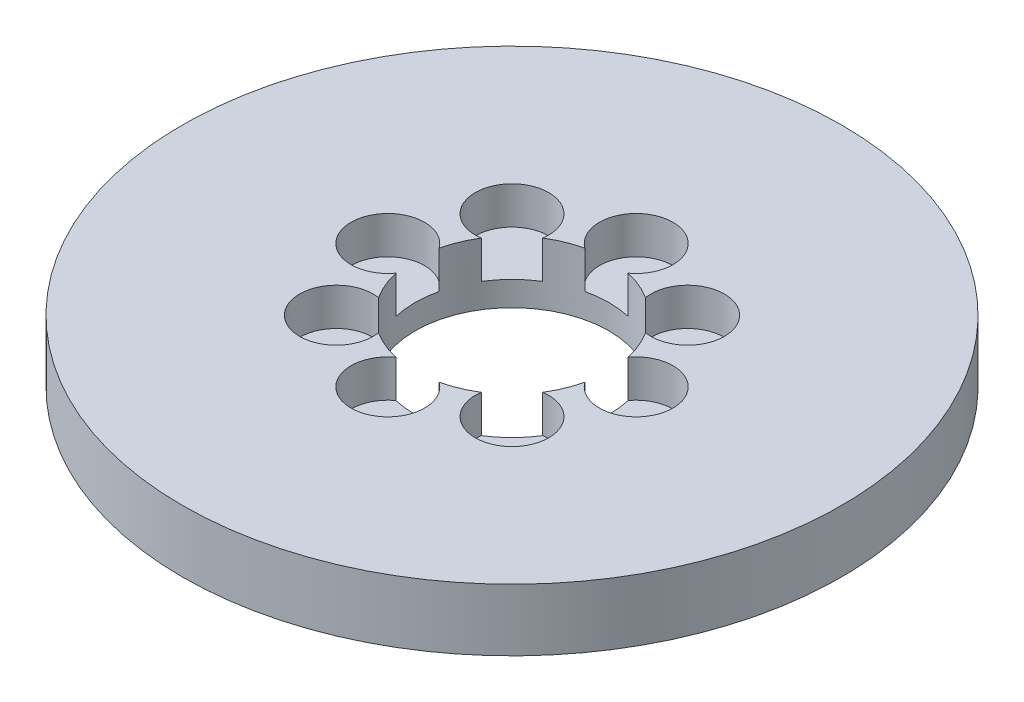
ISO-10303-21;
HEADER;
FILE_DESCRIPTION(('STEP AP214'),'2;1');
FILE_NAME('part.step','',(''),(''),'','','');
FILE_SCHEMA(('AUTOMOTIVE_DESIGN { 1 0 10303 214 1 1 1 1 }'));
ENDSEC;
DATA;
#1=APPLICATION_CONTEXT('core data for automotive mechanical design processes');
#2=APPLICATION_PROTOCOL_DEFINITION('international standard','automotive_design',2000,#1);
#3=PRODUCT_CONTEXT('',#1,'mechanical');
#4=PRODUCT('Part','Part','',(#3));
#5=PRODUCT_RELATED_PRODUCT_CATEGORY('part','',(#4));
#6=PRODUCT_DEFINITION_FORMATION('','',#4);
#7=PRODUCT_DEFINITION_CONTEXT('part definition',#1,'design');
#8=PRODUCT_DEFINITION('design','',#6,#7);
#9=PRODUCT_DEFINITION_SHAPE('','',#8);
#10=(LENGTH_UNIT() NAMED_UNIT(*) SI_UNIT(.MILLI.,.METRE.));
#11=(NAMED_UNIT(*) PLANE_ANGLE_UNIT() SI_UNIT($,.RADIAN.));
#12=(NAMED_UNIT(*) SI_UNIT($,.STERADIAN.) SOLID_ANGLE_UNIT());
#13=UNCERTAINTY_MEASURE_WITH_UNIT(LENGTH_MEASURE(1.E-05),#10,'distance_accuracy_value','');
#14=(GEOMETRIC_REPRESENTATION_CONTEXT(3) GLOBAL_UNCERTAINTY_ASSIGNED_CONTEXT((#13)) GLOBAL_UNIT_ASSIGNED_CONTEXT((#10,
#11,#12)) REPRESENTATION_CONTEXT('',''));
#15=CARTESIAN_POINT('',(0.,0.,0.));
#16=DIRECTION('',(0.,0.,1.));
#17=DIRECTION('',(1.,0.,0.));
#18=AXIS2_PLACEMENT_3D('',#15,#16,#17);
#19=CARTESIAN_POINT('',(0.,16.,0.));
#20=DIRECTION('',(0.,-1.,0.));
#21=DIRECTION('',(0.,0.,-1.));
#22=AXIS2_PLACEMENT_3D('',#19,#20,#21);
#23=CYLINDRICAL_SURFACE('',#22,85.);
#24=CARTESIAN_POINT('',(0.,16.,0.));
#25=DIRECTION('',(0.,1.,0.));
#26=DIRECTION('',(0.,0.,1.));
#27=AXIS2_PLACEMENT_3D('',#24,#25,#26);
#28=CIRCLE('',#27,85.);
#29=CARTESIAN_POINT('',(0.,16.,85.));
#30=VERTEX_POINT('',#29);
#31=EDGE_CURVE('E195',#30,#30,#28,.T.);
#32=ORIENTED_EDGE('',*,*,#31,.F.);
#33=EDGE_LOOP('',(#32));
#34=FACE_BOUND('',#33,.T.);
#35=CARTESIAN_POINT('',(0.,0.,0.));
#36=DIRECTION('',(0.,1.,0.));
#37=DIRECTION('',(0.,0.,1.));
#38=AXIS2_PLACEMENT_3D('',#35,#36,#37);
#39=CIRCLE('',#38,85.);
#40=CARTESIAN_POINT('',(0.,0.,85.));
#41=VERTEX_POINT('',#40);
#42=EDGE_CURVE('E179',#41,#41,#39,.T.);
#43=ORIENTED_EDGE('',*,*,#42,.T.);
#44=EDGE_LOOP('',(#43));
#45=FACE_BOUND('',#44,.T.);
#46=ADVANCED_FACE('F39',(#34,#45),#23,.T.);
#47=CARTESIAN_POINT('',(0.,16.,0.));
#48=DIRECTION('',(0.,1.,0.));
#49=DIRECTION('',(0.,0.,1.));
#50=AXIS2_PLACEMENT_3D('',#47,#48,#49);
#51=PLANE('',#50);
#52=CARTESIAN_POINT('',(1.11835622475509E-13,16.,32.030995334652));
#53=DIRECTION('',(0.,1.,0.));
#54=DIRECTION('',(1.,0.,0.));
#55=AXIS2_PLACEMENT_3D('',#52,#53,#54);
#56=CIRCLE('',#55,9.48192485380572);
#57=CARTESIAN_POINT('',(-5.58471411031341,16.,24.3682368731524));
#58=VERTEX_POINT('',#57);
#59=CARTESIAN_POINT('',(5.58471411031358,16.,24.3682368731524));
#60=VERTEX_POINT('',#59);
#61=EDGE_CURVE('E176',#58,#60,#56,.T.);
#62=ORIENTED_EDGE('',*,*,#61,.F.);
#63=CARTESIAN_POINT('',(0.,16.,0.));
#64=DIRECTION('',(0.,1.,0.));
#65=DIRECTION('',(0.,0.,1.));
#66=AXIS2_PLACEMENT_3D('',#63,#64,#65);
#67=CIRCLE('',#66,25.);
#68=CARTESIAN_POINT('',(-13.2819563201752,16.,21.179934756957));
#69=VERTEX_POINT('',#68);
#70=EDGE_CURVE('E166',#69,#58,#67,.T.);
#71=ORIENTED_EDGE('',*,*,#70,.F.);
#72=CARTESIAN_POINT('',(-22.6493340092871,16.,22.6493340092872));
#73=DIRECTION('',(0.,1.,0.));
#74=DIRECTION('',(0.707106781186549,0.,0.707106781186546));
#75=AXIS2_PLACEMENT_3D('',#72,#73,#74);
#76=CIRCLE('',#75,9.48192485380572);
#77=CARTESIAN_POINT('',(-21.179934756957,16.,13.2819563201753));
#78=VERTEX_POINT('',#77);
#79=EDGE_CURVE('E147',#78,#69,#76,.T.);
#80=ORIENTED_EDGE('',*,*,#79,.F.);
#81=CARTESIAN_POINT('',(-24.3682368731524,16.,5.5847141103135));
#82=VERTEX_POINT('',#81);
#83=EDGE_CURVE('E180',#82,#78,#67,.T.);
#84=ORIENTED_EDGE('',*,*,#83,.F.);
#85=CARTESIAN_POINT('',(-32.030995334652,16.,0.));
#86=DIRECTION('',(0.,1.,0.));
#87=DIRECTION('',(0.,0.,1.));
#88=AXIS2_PLACEMENT_3D('',#85,#86,#87);
#89=CIRCLE('',#88,9.48192485380572);
#90=CARTESIAN_POINT('',(-24.3682368731524,16.,-5.5847141103135));
#91=VERTEX_POINT('',#90);
#92=EDGE_CURVE('E186',#91,#82,#89,.T.);
#93=ORIENTED_EDGE('',*,*,#92,.F.);
#94=CARTESIAN_POINT('',(-21.1799347569572,16.,-13.281956320175));
#95=VERTEX_POINT('',#94);
#96=EDGE_CURVE('E182',#95,#91,#67,.T.);
#97=ORIENTED_EDGE('',*,*,#96,.F.);
#98=CARTESIAN_POINT('',(-22.6493340092874,16.,-22.6493340092868));
#99=DIRECTION('',(0.,1.,0.));
#100=DIRECTION('',(-0.707106781186539,0.,0.707106781186556));
#101=AXIS2_PLACEMENT_3D('',#98,#99,#100);
#102=CIRCLE('',#101,9.48192485380572);
#103=CARTESIAN_POINT('',(-13.2819563201755,16.,-21.1799347569569));
#104=VERTEX_POINT('',#103);
#105=EDGE_CURVE('E446',#104,#95,#102,.T.);
#106=ORIENTED_EDGE('',*,*,#105,.F.);
#107=CARTESIAN_POINT('',(-5.58471411031375,16.,-24.3682368731524));
#108=VERTEX_POINT('',#107);
#109=EDGE_CURVE('E452',#108,#104,#67,.T.);
#110=ORIENTED_EDGE('',*,*,#109,.F.);
#111=CARTESIAN_POINT('',(-3.35506867426527E-13,16.,-32.030995334652));
#112=DIRECTION('',(0.,1.,0.));
#113=DIRECTION('',(-1.,0.,0.));
#114=AXIS2_PLACEMENT_3D('',#111,#112,#113);
#115=CIRCLE('',#114,9.48192485380572);
#116=CARTESIAN_POINT('',(5.58471411031324,16.,-24.3682368731525));
#117=VERTEX_POINT('',#116);
#118=EDGE_CURVE('E477',#117,#108,#115,.T.);
#119=ORIENTED_EDGE('',*,*,#118,.F.);
#120=CARTESIAN_POINT('',(13.2819563201751,16.,-21.1799347569571));
#121=VERTEX_POINT('',#120);
#122=EDGE_CURVE('E460',#121,#117,#67,.T.);
#123=ORIENTED_EDGE('',*,*,#122,.F.);
#124=CARTESIAN_POINT('',(22.6493340092869,16.,-22.6493340092873));
#125=DIRECTION('',(0.,1.,0.));
#126=DIRECTION('',(-0.707106781186554,0.,-0.707106781186541));
#127=AXIS2_PLACEMENT_3D('',#124,#125,#126);
#128=CIRCLE('',#127,9.48192485380572);
#129=CARTESIAN_POINT('',(21.1799347569569,16.,-13.2819563201755));
#130=VERTEX_POINT('',#129);
#131=EDGE_CURVE('E464',#130,#121,#128,.T.);
#132=ORIENTED_EDGE('',*,*,#131,.F.);
#133=CARTESIAN_POINT('',(24.3682368731524,16.,-5.5847141103135));
#134=VERTEX_POINT('',#133);
#135=EDGE_CURVE('E459',#134,#130,#67,.T.);
#136=ORIENTED_EDGE('',*,*,#135,.F.);
#137=CARTESIAN_POINT('',(32.030995334652,16.,0.));
#138=DIRECTION('',(0.,1.,0.));
#139=DIRECTION('',(0.,0.,-1.));
#140=AXIS2_PLACEMENT_3D('',#137,#138,#139);
#141=CIRCLE('',#140,9.48192485380572);
#142=CARTESIAN_POINT('',(24.3682368731524,16.,5.5847141103135));
#143=VERTEX_POINT('',#142);
#144=EDGE_CURVE('E469',#143,#134,#141,.T.);
#145=ORIENTED_EDGE('',*,*,#144,.F.);
#146=CARTESIAN_POINT('',(21.1799347569571,16.,13.2819563201752));
#147=VERTEX_POINT('',#146);
#148=EDGE_CURVE('E181',#147,#143,#67,.T.);
#149=ORIENTED_EDGE('',*,*,#148,.F.);
#150=CARTESIAN_POINT('',(22.6493340092872,16.,22.649334009287));
#151=DIRECTION('',(0.,1.,0.));
#152=DIRECTION('',(0.707106781186544,0.,-0.707106781186551));
#153=AXIS2_PLACEMENT_3D('',#150,#151,#152);
#154=CIRCLE('',#153,9.48192485380572);
#155=CARTESIAN_POINT('',(13.2819563201754,16.,21.1799347569569));
#156=VERTEX_POINT('',#155);
#157=EDGE_CURVE('E475',#156,#147,#154,.T.);
#158=ORIENTED_EDGE('',*,*,#157,.F.);
#159=EDGE_CURVE('E177',#60,#156,#67,.T.);
#160=ORIENTED_EDGE('',*,*,#159,.F.);
#161=EDGE_LOOP('',(#62,#71,#80,#84,#93,#97,#106,#110,#119,#123,#132,#136,#145,#149,#158,#160));
#162=FACE_BOUND('',#161,.T.);
#163=ORIENTED_EDGE('',*,*,#31,.T.);
#164=EDGE_LOOP('',(#163));
#165=FACE_BOUND('',#164,.T.);
#166=ADVANCED_FACE('F172',(#162,#165),#51,.T.);
#167=CARTESIAN_POINT('',(0.,0.,0.));
#168=DIRECTION('',(0.,1.,0.));
#169=DIRECTION('',(0.,0.,1.));
#170=AXIS2_PLACEMENT_3D('',#167,#168,#169);
#171=PLANE('',#170);
#172=CARTESIAN_POINT('',(0.,0.,0.));
#173=DIRECTION('',(0.,1.,0.));
#174=DIRECTION('',(0.,0.,1.));
#175=AXIS2_PLACEMENT_3D('',#172,#173,#174);
#176=CIRCLE('',#175,25.);
#177=CARTESIAN_POINT('',(0.,0.,25.));
#178=VERTEX_POINT('',#177);
#179=EDGE_CURVE('E187',#178,#178,#176,.T.);
#180=ORIENTED_EDGE('',*,*,#179,.T.);
#181=EDGE_LOOP('',(#180));
#182=FACE_BOUND('',#181,.T.);
#183=ORIENTED_EDGE('',*,*,#42,.F.);
#184=EDGE_LOOP('',(#183));
#185=FACE_BOUND('',#184,.T.);
#186=ADVANCED_FACE('F270',(#182,#185),#171,.F.);
#187=CARTESIAN_POINT('',(0.,16.,0.));
#188=DIRECTION('',(0.,-1.,0.));
#189=DIRECTION('',(0.,0.,-1.));
#190=AXIS2_PLACEMENT_3D('',#187,#188,#189);
#191=CYLINDRICAL_SURFACE('',#190,25.);
#192=DIRECTION('',(0.,1.,0.));
#193=VECTOR('',#192,1.);
#194=CARTESIAN_POINT('',(-5.58471411031342,11.1634950913703,24.3682368731524));
#195=LINE('',#194,#193);
#196=CARTESIAN_POINT('',(-5.58471411031341,6.32699018274064,24.3682368731524));
#197=VERTEX_POINT('',#196);
#198=EDGE_CURVE('E11',#197,#58,#195,.T.);
#199=ORIENTED_EDGE('',*,*,#198,.F.);
#200=CARTESIAN_POINT('',(0.,6.32699018274064,0.));
#201=DIRECTION('',(0.,1.,0.));
#202=DIRECTION('',(0.,0.,1.));
#203=AXIS2_PLACEMENT_3D('',#200,#201,#202);
#204=CIRCLE('',#203,25.);
#205=CARTESIAN_POINT('',(5.58471411031358,6.32699018274064,24.3682368731524));
#206=VERTEX_POINT('',#205);
#207=EDGE_CURVE('E250',#197,#206,#204,.T.);
#208=ORIENTED_EDGE('',*,*,#207,.T.);
#209=DIRECTION('',(0.,1.,0.));
#210=VECTOR('',#209,1.);
#211=CARTESIAN_POINT('',(5.58471411031359,11.1634950913703,24.3682368731524));
#212=LINE('',#211,#210);
#213=EDGE_CURVE('E46',#60,#206,#212,.F.);
#214=ORIENTED_EDGE('',*,*,#213,.F.);
#215=ORIENTED_EDGE('',*,*,#159,.T.);
#216=DIRECTION('',(0.,1.,0.));
#217=VECTOR('',#216,1.);
#218=CARTESIAN_POINT('',(13.2819563201754,11.1634950913703,21.179934756957));
#219=LINE('',#218,#217);
#220=CARTESIAN_POINT('',(13.2819563201754,6.32699018274064,21.1799347569569));
#221=VERTEX_POINT('',#220);
#222=EDGE_CURVE('E244',#221,#156,#219,.T.);
#223=ORIENTED_EDGE('',*,*,#222,.F.);
#224=CARTESIAN_POINT('',(0.,6.32699018274064,0.));
#225=DIRECTION('',(0.,1.,0.));
#226=DIRECTION('',(0.,0.,1.));
#227=AXIS2_PLACEMENT_3D('',#224,#225,#226);
#228=CIRCLE('',#227,25.);
#229=CARTESIAN_POINT('',(21.1799347569571,6.32699018274064,13.2819563201752));
#230=VERTEX_POINT('',#229);
#231=EDGE_CURVE('E238',#221,#230,#228,.T.);
#232=ORIENTED_EDGE('',*,*,#231,.T.);
#233=DIRECTION('',(0.,1.,0.));
#234=VECTOR('',#233,1.);
#235=CARTESIAN_POINT('',(21.1799347569571,11.1634950913703,13.2819563201752));
#236=LINE('',#235,#234);
#237=EDGE_CURVE('E242',#147,#230,#236,.F.);
#238=ORIENTED_EDGE('',*,*,#237,.F.);
#239=ORIENTED_EDGE('',*,*,#148,.T.);
#240=DIRECTION('',(0.,1.,0.));
#241=VECTOR('',#240,1.);
#242=CARTESIAN_POINT('',(24.3682368731524,11.1634950913703,5.58471411031351));
#243=LINE('',#242,#241);
#244=CARTESIAN_POINT('',(24.3682368731524,6.32699018274064,5.5847141103135));
#245=VERTEX_POINT('',#244);
#246=EDGE_CURVE('E236',#245,#143,#243,.T.);
#247=ORIENTED_EDGE('',*,*,#246,.F.);
#248=CARTESIAN_POINT('',(0.,6.32699018274064,0.));
#249=DIRECTION('',(0.,1.,0.));
#250=DIRECTION('',(0.,0.,1.));
#251=AXIS2_PLACEMENT_3D('',#248,#249,#250);
#252=CIRCLE('',#251,25.);
#253=CARTESIAN_POINT('',(24.3682368731524,6.32699018274064,-5.5847141103135));
#254=VERTEX_POINT('',#253);
#255=EDGE_CURVE('E235',#245,#254,#252,.T.);
#256=ORIENTED_EDGE('',*,*,#255,.T.);
#257=DIRECTION('',(0.,1.,0.));
#258=VECTOR('',#257,1.);
#259=CARTESIAN_POINT('',(24.3682368731524,11.1634950913703,-5.58471411031351));
#260=LINE('',#259,#258);
#261=EDGE_CURVE('E234',#134,#254,#260,.F.);
#262=ORIENTED_EDGE('',*,*,#261,.F.);
#263=ORIENTED_EDGE('',*,*,#135,.T.);
#264=DIRECTION('',(0.,1.,0.));
#265=VECTOR('',#264,1.);
#266=CARTESIAN_POINT('',(21.1799347569569,11.1634950913703,-13.2819563201755));
#267=LINE('',#266,#265);
#268=CARTESIAN_POINT('',(21.1799347569569,6.32699018274064,-13.2819563201755));
#269=VERTEX_POINT('',#268);
#270=EDGE_CURVE('E229',#269,#130,#267,.T.);
#271=ORIENTED_EDGE('',*,*,#270,.F.);
#272=CARTESIAN_POINT('',(0.,6.32699018274064,0.));
#273=DIRECTION('',(0.,1.,0.));
#274=DIRECTION('',(0.,0.,1.));
#275=AXIS2_PLACEMENT_3D('',#272,#273,#274);
#276=CIRCLE('',#275,25.);
#277=CARTESIAN_POINT('',(13.2819563201751,6.32699018274064,-21.1799347569571));
#278=VERTEX_POINT('',#277);
#279=EDGE_CURVE('E221',#269,#278,#276,.T.);
#280=ORIENTED_EDGE('',*,*,#279,.T.);
#281=DIRECTION('',(0.,1.,0.));
#282=VECTOR('',#281,1.);
#283=CARTESIAN_POINT('',(13.2819563201751,11.1634950913703,-21.1799347569571));
#284=LINE('',#283,#282);
#285=EDGE_CURVE('E230',#121,#278,#284,.F.);
#286=ORIENTED_EDGE('',*,*,#285,.F.);
#287=ORIENTED_EDGE('',*,*,#122,.T.);
#288=DIRECTION('',(0.,1.,0.));
#289=VECTOR('',#288,1.);
#290=CARTESIAN_POINT('',(5.58471411031325,11.1634950913703,-24.3682368731525));
#291=LINE('',#290,#289);
#292=CARTESIAN_POINT('',(5.58471411031324,6.32699018274064,-24.3682368731525));
#293=VERTEX_POINT('',#292);
#294=EDGE_CURVE('E225',#293,#117,#291,.T.);
#295=ORIENTED_EDGE('',*,*,#294,.F.);
#296=CARTESIAN_POINT('',(0.,6.32699018274064,0.));
#297=DIRECTION('',(0.,1.,0.));
#298=DIRECTION('',(0.,0.,1.));
#299=AXIS2_PLACEMENT_3D('',#296,#297,#298);
#300=CIRCLE('',#299,25.);
#301=CARTESIAN_POINT('',(-5.58471411031375,6.32699018274064,-24.3682368731524));
#302=VERTEX_POINT('',#301);
#303=EDGE_CURVE('E216',#293,#302,#300,.T.);
#304=ORIENTED_EDGE('',*,*,#303,.T.);
#305=DIRECTION('',(0.,1.,0.));
#306=VECTOR('',#305,1.);
#307=CARTESIAN_POINT('',(-5.58471411031376,11.1634950913703,-24.3682368731524));
#308=LINE('',#307,#306);
#309=EDGE_CURVE('E218',#108,#302,#308,.F.);
#310=ORIENTED_EDGE('',*,*,#309,.F.);
#311=ORIENTED_EDGE('',*,*,#109,.T.);
#312=DIRECTION('',(0.,1.,0.));
#313=VECTOR('',#312,1.);
#314=CARTESIAN_POINT('',(-13.2819563201755,11.1634950913703,-21.1799347569569));
#315=LINE('',#314,#313);
#316=CARTESIAN_POINT('',(-13.2819563201755,6.32699018274064,-21.1799347569569));
#317=VERTEX_POINT('',#316);
#318=EDGE_CURVE('E212',#317,#104,#315,.T.);
#319=ORIENTED_EDGE('',*,*,#318,.F.);
#320=CARTESIAN_POINT('',(0.,6.32699018274064,0.));
#321=DIRECTION('',(0.,1.,0.));
#322=DIRECTION('',(0.,0.,1.));
#323=AXIS2_PLACEMENT_3D('',#320,#321,#322);
#324=CIRCLE('',#323,25.);
#325=CARTESIAN_POINT('',(-21.1799347569572,6.32699018274064,-13.281956320175));
#326=VERTEX_POINT('',#325);
#327=EDGE_CURVE('E208',#317,#326,#324,.T.);
#328=ORIENTED_EDGE('',*,*,#327,.T.);
#329=DIRECTION('',(0.,1.,0.));
#330=VECTOR('',#329,1.);
#331=CARTESIAN_POINT('',(-21.1799347569572,11.1634950913703,-13.281956320175));
#332=LINE('',#331,#330);
#333=EDGE_CURVE('E211',#95,#326,#332,.F.);
#334=ORIENTED_EDGE('',*,*,#333,.F.);
#335=ORIENTED_EDGE('',*,*,#96,.T.);
#336=DIRECTION('',(0.,1.,0.));
#337=VECTOR('',#336,1.);
#338=CARTESIAN_POINT('',(-24.3682368731524,11.1634950913703,-5.58471411031351));
#339=LINE('',#338,#337);
#340=CARTESIAN_POINT('',(-24.3682368731524,6.32699018274064,-5.5847141103135));
#341=VERTEX_POINT('',#340);
#342=EDGE_CURVE('E201',#341,#91,#339,.T.);
#343=ORIENTED_EDGE('',*,*,#342,.F.);
#344=CARTESIAN_POINT('',(0.,6.32699018274064,0.));
#345=DIRECTION('',(0.,1.,0.));
#346=DIRECTION('',(0.,0.,1.));
#347=AXIS2_PLACEMENT_3D('',#344,#345,#346);
#348=CIRCLE('',#347,25.);
#349=CARTESIAN_POINT('',(-24.3682368731524,6.32699018274064,5.5847141103135));
#350=VERTEX_POINT('',#349);
#351=EDGE_CURVE('E194',#341,#350,#348,.T.);
#352=ORIENTED_EDGE('',*,*,#351,.T.);
#353=DIRECTION('',(0.,1.,0.));
#354=VECTOR('',#353,1.);
#355=CARTESIAN_POINT('',(-24.3682368731524,11.1634950913703,5.58471411031351));
#356=LINE('',#355,#354);
#357=EDGE_CURVE('E199',#82,#350,#356,.F.);
#358=ORIENTED_EDGE('',*,*,#357,.F.);
#359=ORIENTED_EDGE('',*,*,#83,.T.);
#360=DIRECTION('',(0.,1.,0.));
#361=VECTOR('',#360,1.);
#362=CARTESIAN_POINT('',(-21.179934756957,11.1634950913703,13.2819563201753));
#363=LINE('',#362,#361);
#364=CARTESIAN_POINT('',(-21.179934756957,6.32699018274064,13.2819563201753));
#365=VERTEX_POINT('',#364);
#366=EDGE_CURVE('E160',#365,#78,#363,.T.);
#367=ORIENTED_EDGE('',*,*,#366,.F.);
#368=CARTESIAN_POINT('',(0.,6.32699018274064,0.));
#369=DIRECTION('',(0.,1.,0.));
#370=DIRECTION('',(0.,0.,1.));
#371=AXIS2_PLACEMENT_3D('',#368,#369,#370);
#372=CIRCLE('',#371,25.);
#373=CARTESIAN_POINT('',(-13.2819563201752,6.32699018274064,21.179934756957));
#374=VERTEX_POINT('',#373);
#375=EDGE_CURVE('E168',#365,#374,#372,.T.);
#376=ORIENTED_EDGE('',*,*,#375,.T.);
#377=DIRECTION('',(0.,1.,0.));
#378=VECTOR('',#377,1.);
#379=CARTESIAN_POINT('',(-13.2819563201752,11.1634950913703,21.179934756957));
#380=LINE('',#379,#378);
#381=EDGE_CURVE('E152',#69,#374,#380,.F.);
#382=ORIENTED_EDGE('',*,*,#381,.F.);
#383=ORIENTED_EDGE('',*,*,#70,.T.);
#384=EDGE_LOOP('',(#199,#208,#214,#215,#223,#232,#238,#239,#247,#256,#262,#263,#271,#280,#286,
#287,#295,#304,#310,#311,#319,#328,#334,#335,#343,#352,#358,#359,#367,#376,#382,#383));
#385=FACE_BOUND('',#384,.T.);
#386=ORIENTED_EDGE('',*,*,#179,.F.);
#387=EDGE_LOOP('',(#386));
#388=FACE_BOUND('',#387,.T.);
#389=ADVANCED_FACE('F170',(#385,#388),#191,.F.);
#390=CARTESIAN_POINT('',(-32.030995334652,6.32699018274064,0.));
#391=DIRECTION('',(0.,1.,0.));
#392=DIRECTION('',(0.,0.,1.));
#393=AXIS2_PLACEMENT_3D('',#390,#391,#392);
#394=CYLINDRICAL_SURFACE('',#393,9.48192485380572);
#395=ORIENTED_EDGE('',*,*,#342,.T.);
#396=ORIENTED_EDGE('',*,*,#92,.T.);
#397=ORIENTED_EDGE('',*,*,#357,.T.);
#398=CARTESIAN_POINT('',(-32.030995334652,6.32699018274064,0.));
#399=DIRECTION('',(0.,1.,0.));
#400=DIRECTION('',(0.,0.,1.));
#401=AXIS2_PLACEMENT_3D('',#398,#399,#400);
#402=CIRCLE('',#401,9.48192485380572);
#403=EDGE_CURVE('E191',#341,#350,#402,.T.);
#404=ORIENTED_EDGE('',*,*,#403,.F.);
#405=EDGE_LOOP('',(#395,#396,#397,#404));
#406=FACE_BOUND('',#405,.T.);
#407=ADVANCED_FACE('F279',(#406),#394,.F.);
#408=CARTESIAN_POINT('',(-32.030995334652,6.32699018274064,0.));
#409=DIRECTION('',(0.,1.,0.));
#410=DIRECTION('',(0.,0.,1.));
#411=AXIS2_PLACEMENT_3D('',#408,#409,#410);
#412=PLANE('',#411);
#413=ORIENTED_EDGE('',*,*,#403,.T.);
#414=ORIENTED_EDGE('',*,*,#351,.F.);
#415=EDGE_LOOP('',(#413,#414));
#416=FACE_BOUND('',#415,.T.);
#417=ADVANCED_FACE('F285',(#416),#412,.T.);
#418=CARTESIAN_POINT('',(-22.6493340092871,6.32699018274064,22.6493340092872));
#419=DIRECTION('',(0.,1.,0.));
#420=DIRECTION('',(0.,0.,1.));
#421=AXIS2_PLACEMENT_3D('',#418,#419,#420);
#422=CYLINDRICAL_SURFACE('',#421,9.48192485380572);
#423=ORIENTED_EDGE('',*,*,#366,.T.);
#424=ORIENTED_EDGE('',*,*,#79,.T.);
#425=ORIENTED_EDGE('',*,*,#381,.T.);
#426=CARTESIAN_POINT('',(-22.6493340092871,6.32699018274064,22.6493340092872));
#427=DIRECTION('',(0.,1.,0.));
#428=DIRECTION('',(0.707106781186549,0.,0.707106781186546));
#429=AXIS2_PLACEMENT_3D('',#426,#427,#428);
#430=CIRCLE('',#429,9.48192485380572);
#431=EDGE_CURVE('E165',#365,#374,#430,.T.);
#432=ORIENTED_EDGE('',*,*,#431,.F.);
#433=EDGE_LOOP('',(#423,#424,#425,#432));
#434=FACE_BOUND('',#433,.T.);
#435=ADVANCED_FACE('F155',(#434),#422,.F.);
#436=CARTESIAN_POINT('',(-22.6493340092871,6.32699018274064,22.6493340092872));
#437=DIRECTION('',(0.,1.,0.));
#438=DIRECTION('',(0.707106781186549,0.,0.707106781186546));
#439=AXIS2_PLACEMENT_3D('',#436,#437,#438);
#440=PLANE('',#439);
#441=ORIENTED_EDGE('',*,*,#431,.T.);
#442=ORIENTED_EDGE('',*,*,#375,.F.);
#443=EDGE_LOOP('',(#441,#442));
#444=FACE_BOUND('',#443,.T.);
#445=ADVANCED_FACE('F288',(#444),#440,.T.);
#446=CARTESIAN_POINT('',(-22.6493340092874,6.32699018274064,-22.6493340092868));
#447=DIRECTION('',(0.,1.,0.));
#448=DIRECTION('',(0.,0.,1.));
#449=AXIS2_PLACEMENT_3D('',#446,#447,#448);
#450=CYLINDRICAL_SURFACE('',#449,9.48192485380572);
#451=ORIENTED_EDGE('',*,*,#318,.T.);
#452=ORIENTED_EDGE('',*,*,#105,.T.);
#453=ORIENTED_EDGE('',*,*,#333,.T.);
#454=CARTESIAN_POINT('',(-22.6493340092874,6.32699018274064,-22.6493340092868));
#455=DIRECTION('',(0.,1.,0.));
#456=DIRECTION('',(-0.707106781186539,0.,0.707106781186556));
#457=AXIS2_PLACEMENT_3D('',#454,#455,#456);
#458=CIRCLE('',#457,9.48192485380572);
#459=EDGE_CURVE('E447',#317,#326,#458,.T.);
#460=ORIENTED_EDGE('',*,*,#459,.F.);
#461=EDGE_LOOP('',(#451,#452,#453,#460));
#462=FACE_BOUND('',#461,.T.);
#463=ADVANCED_FACE('F295',(#462),#450,.F.);
#464=CARTESIAN_POINT('',(-22.6493340092874,6.32699018274064,-22.6493340092868));
#465=DIRECTION('',(0.,1.,0.));
#466=DIRECTION('',(-0.707106781186539,0.,0.707106781186556));
#467=AXIS2_PLACEMENT_3D('',#464,#465,#466);
#468=PLANE('',#467);
#469=ORIENTED_EDGE('',*,*,#459,.T.);
#470=ORIENTED_EDGE('',*,*,#327,.F.);
#471=EDGE_LOOP('',(#469,#470));
#472=FACE_BOUND('',#471,.T.);
#473=ADVANCED_FACE('F375',(#472),#468,.T.);
#474=CARTESIAN_POINT('',(-3.35506867426527E-13,6.32699018274064,-32.030995334652));
#475=DIRECTION('',(0.,1.,0.));
#476=DIRECTION('',(0.,0.,1.));
#477=AXIS2_PLACEMENT_3D('',#474,#475,#476);
#478=CYLINDRICAL_SURFACE('',#477,9.48192485380572);
#479=ORIENTED_EDGE('',*,*,#294,.T.);
#480=ORIENTED_EDGE('',*,*,#118,.T.);
#481=ORIENTED_EDGE('',*,*,#309,.T.);
#482=CARTESIAN_POINT('',(-3.35506867426527E-13,6.32699018274064,-32.030995334652));
#483=DIRECTION('',(0.,1.,0.));
#484=DIRECTION('',(-1.,0.,0.));
#485=AXIS2_PLACEMENT_3D('',#482,#483,#484);
#486=CIRCLE('',#485,9.48192485380572);
#487=EDGE_CURVE('E467',#293,#302,#486,.T.);
#488=ORIENTED_EDGE('',*,*,#487,.F.);
#489=EDGE_LOOP('',(#479,#480,#481,#488));
#490=FACE_BOUND('',#489,.T.);
#491=ADVANCED_FACE('F361',(#490),#478,.F.);
#492=CARTESIAN_POINT('',(-3.35506867426527E-13,6.32699018274064,-32.030995334652));
#493=DIRECTION('',(0.,1.,0.));
#494=DIRECTION('',(-1.,0.,0.));
#495=AXIS2_PLACEMENT_3D('',#492,#493,#494);
#496=PLANE('',#495);
#497=ORIENTED_EDGE('',*,*,#487,.T.);
#498=ORIENTED_EDGE('',*,*,#303,.F.);
#499=EDGE_LOOP('',(#497,#498));
#500=FACE_BOUND('',#499,.T.);
#501=ADVANCED_FACE('F297',(#500),#496,.T.);
#502=CARTESIAN_POINT('',(22.6493340092869,6.32699018274064,-22.6493340092873));
#503=DIRECTION('',(0.,1.,0.));
#504=DIRECTION('',(0.,0.,1.));
#505=AXIS2_PLACEMENT_3D('',#502,#503,#504);
#506=CYLINDRICAL_SURFACE('',#505,9.48192485380572);
#507=ORIENTED_EDGE('',*,*,#270,.T.);
#508=ORIENTED_EDGE('',*,*,#131,.T.);
#509=ORIENTED_EDGE('',*,*,#285,.T.);
#510=CARTESIAN_POINT('',(22.6493340092869,6.32699018274064,-22.6493340092873));
#511=DIRECTION('',(0.,1.,0.));
#512=DIRECTION('',(-0.707106781186554,0.,-0.707106781186541));
#513=AXIS2_PLACEMENT_3D('',#510,#511,#512);
#514=CIRCLE('',#513,9.48192485380572);
#515=EDGE_CURVE('E470',#269,#278,#514,.T.);
#516=ORIENTED_EDGE('',*,*,#515,.F.);
#517=EDGE_LOOP('',(#507,#508,#509,#516));
#518=FACE_BOUND('',#517,.T.);
#519=ADVANCED_FACE('F294',(#518),#506,.F.);
#520=CARTESIAN_POINT('',(22.6493340092869,6.32699018274064,-22.6493340092873));
#521=DIRECTION('',(0.,1.,0.));
#522=DIRECTION('',(-0.707106781186554,0.,-0.707106781186541));
#523=AXIS2_PLACEMENT_3D('',#520,#521,#522);
#524=PLANE('',#523);
#525=ORIENTED_EDGE('',*,*,#515,.T.);
#526=ORIENTED_EDGE('',*,*,#279,.F.);
#527=EDGE_LOOP('',(#525,#526));
#528=FACE_BOUND('',#527,.T.);
#529=ADVANCED_FACE('F300',(#528),#524,.T.);
#530=CARTESIAN_POINT('',(32.030995334652,6.32699018274064,0.));
#531=DIRECTION('',(0.,1.,0.));
#532=DIRECTION('',(0.,0.,1.));
#533=AXIS2_PLACEMENT_3D('',#530,#531,#532);
#534=CYLINDRICAL_SURFACE('',#533,9.48192485380572);
#535=ORIENTED_EDGE('',*,*,#246,.T.);
#536=ORIENTED_EDGE('',*,*,#144,.T.);
#537=ORIENTED_EDGE('',*,*,#261,.T.);
#538=CARTESIAN_POINT('',(32.030995334652,6.32699018274064,0.));
#539=DIRECTION('',(0.,1.,0.));
#540=DIRECTION('',(0.,0.,-1.));
#541=AXIS2_PLACEMENT_3D('',#538,#539,#540);
#542=CIRCLE('',#541,9.48192485380572);
#543=EDGE_CURVE('E472',#245,#254,#542,.T.);
#544=ORIENTED_EDGE('',*,*,#543,.F.);
#545=EDGE_LOOP('',(#535,#536,#537,#544));
#546=FACE_BOUND('',#545,.T.);
#547=ADVANCED_FACE('F305',(#546),#534,.F.);
#548=CARTESIAN_POINT('',(32.030995334652,6.32699018274064,0.));
#549=DIRECTION('',(0.,1.,0.));
#550=DIRECTION('',(0.,0.,-1.));
#551=AXIS2_PLACEMENT_3D('',#548,#549,#550);
#552=PLANE('',#551);
#553=ORIENTED_EDGE('',*,*,#543,.T.);
#554=ORIENTED_EDGE('',*,*,#255,.F.);
#555=EDGE_LOOP('',(#553,#554));
#556=FACE_BOUND('',#555,.T.);
#557=ADVANCED_FACE('F308',(#556),#552,.T.);
#558=CARTESIAN_POINT('',(22.6493340092872,6.32699018274064,22.649334009287));
#559=DIRECTION('',(0.,1.,0.));
#560=DIRECTION('',(0.,0.,1.));
#561=AXIS2_PLACEMENT_3D('',#558,#559,#560);
#562=CYLINDRICAL_SURFACE('',#561,9.48192485380572);
#563=ORIENTED_EDGE('',*,*,#222,.T.);
#564=ORIENTED_EDGE('',*,*,#157,.T.);
#565=ORIENTED_EDGE('',*,*,#237,.T.);
#566=CARTESIAN_POINT('',(22.6493340092872,6.32699018274064,22.649334009287));
#567=DIRECTION('',(0.,1.,0.));
#568=DIRECTION('',(0.707106781186544,0.,-0.707106781186551));
#569=AXIS2_PLACEMENT_3D('',#566,#567,#568);
#570=CIRCLE('',#569,9.48192485380572);
#571=EDGE_CURVE('E56',#221,#230,#570,.T.);
#572=ORIENTED_EDGE('',*,*,#571,.F.);
#573=EDGE_LOOP('',(#563,#564,#565,#572));
#574=FACE_BOUND('',#573,.T.);
#575=ADVANCED_FACE('F309',(#574),#562,.F.);
#576=CARTESIAN_POINT('',(22.6493340092872,6.32699018274064,22.649334009287));
#577=DIRECTION('',(0.,1.,0.));
#578=DIRECTION('',(0.707106781186544,0.,-0.707106781186551));
#579=AXIS2_PLACEMENT_3D('',#576,#577,#578);
#580=PLANE('',#579);
#581=ORIENTED_EDGE('',*,*,#571,.T.);
#582=ORIENTED_EDGE('',*,*,#231,.F.);
#583=EDGE_LOOP('',(#581,#582));
#584=FACE_BOUND('',#583,.T.);
#585=ADVANCED_FACE('F256',(#584),#580,.T.);
#586=CARTESIAN_POINT('',(1.11835622475509E-13,6.32699018274064,32.030995334652));
#587=DIRECTION('',(0.,1.,0.));
#588=DIRECTION('',(0.,0.,1.));
#589=AXIS2_PLACEMENT_3D('',#586,#587,#588);
#590=CYLINDRICAL_SURFACE('',#589,9.48192485380572);
#591=ORIENTED_EDGE('',*,*,#198,.T.);
#592=ORIENTED_EDGE('',*,*,#61,.T.);
#593=ORIENTED_EDGE('',*,*,#213,.T.);
#594=CARTESIAN_POINT('',(1.11835622475509E-13,6.32699018274064,32.030995334652));
#595=DIRECTION('',(0.,1.,0.));
#596=DIRECTION('',(1.,0.,0.));
#597=AXIS2_PLACEMENT_3D('',#594,#595,#596);
#598=CIRCLE('',#597,9.48192485380572);
#599=EDGE_CURVE('E55',#197,#206,#598,.T.);
#600=ORIENTED_EDGE('',*,*,#599,.F.);
#601=EDGE_LOOP('',(#591,#592,#593,#600));
#602=FACE_BOUND('',#601,.T.);
#603=ADVANCED_FACE('F253',(#602),#590,.F.);
#604=CARTESIAN_POINT('',(1.11835622475509E-13,6.32699018274064,32.030995334652));
#605=DIRECTION('',(0.,1.,0.));
#606=DIRECTION('',(1.,0.,0.));
#607=AXIS2_PLACEMENT_3D('',#604,#605,#606);
#608=PLANE('',#607);
#609=ORIENTED_EDGE('',*,*,#599,.T.);
#610=ORIENTED_EDGE('',*,*,#207,.F.);
#611=EDGE_LOOP('',(#609,#610));
#612=FACE_BOUND('',#611,.T.);
#613=ADVANCED_FACE('F252',(#612),#608,.T.);
#614=CLOSED_SHELL('',(#46,#166,#186,#389,#407,#417,#435,#445,#463,#473,#491,#501,#519,#529,#547,
#557,#575,#585,#603,#613));
#615=MANIFOLD_SOLID_BREP('B2',#614);
#616=ADVANCED_BREP_SHAPE_REPRESENTATION('',(#18,#615),#14);
#617=SHAPE_DEFINITION_REPRESENTATION(#9,#616);
ENDSEC;
END-ISO-10303-21;
